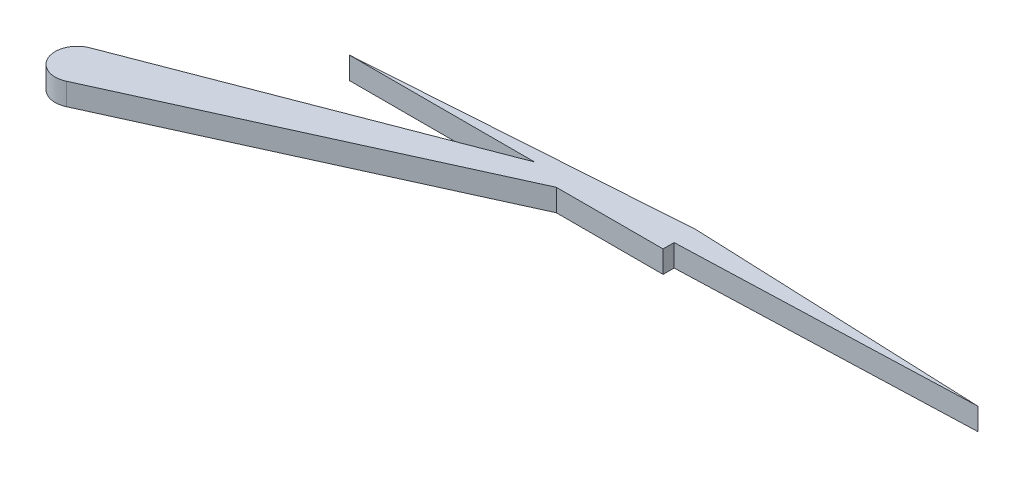
ISO-10303-21;
HEADER;
FILE_DESCRIPTION(('STEP AP214'),'2;1');
FILE_NAME('part.step','',(''),(''),'','','');
FILE_SCHEMA(('AUTOMOTIVE_DESIGN { 1 0 10303 214 1 1 1 1 }'));
ENDSEC;
DATA;
#1=APPLICATION_CONTEXT('core data for automotive mechanical design processes');
#2=APPLICATION_PROTOCOL_DEFINITION('international standard','automotive_design',2000,#1);
#3=PRODUCT_CONTEXT('',#1,'mechanical');
#4=PRODUCT('Part','Part','',(#3));
#5=PRODUCT_RELATED_PRODUCT_CATEGORY('part','',(#4));
#6=PRODUCT_DEFINITION_FORMATION('','',#4);
#7=PRODUCT_DEFINITION_CONTEXT('part definition',#1,'design');
#8=PRODUCT_DEFINITION('design','',#6,#7);
#9=PRODUCT_DEFINITION_SHAPE('','',#8);
#10=(LENGTH_UNIT() NAMED_UNIT(*) SI_UNIT(.MILLI.,.METRE.));
#11=(NAMED_UNIT(*) PLANE_ANGLE_UNIT() SI_UNIT($,.RADIAN.));
#12=(NAMED_UNIT(*) SI_UNIT($,.STERADIAN.) SOLID_ANGLE_UNIT());
#13=UNCERTAINTY_MEASURE_WITH_UNIT(LENGTH_MEASURE(1.E-05),#10,'distance_accuracy_value','');
#14=(GEOMETRIC_REPRESENTATION_CONTEXT(3) GLOBAL_UNCERTAINTY_ASSIGNED_CONTEXT((#13)) GLOBAL_UNIT_ASSIGNED_CONTEXT((#10,
#11,#12)) REPRESENTATION_CONTEXT('',''));
#15=CARTESIAN_POINT('',(0.,0.,0.));
#16=DIRECTION('',(0.,0.,1.));
#17=DIRECTION('',(1.,0.,0.));
#18=AXIS2_PLACEMENT_3D('',#15,#16,#17);
#19=CARTESIAN_POINT('',(0.,1.,0.));
#20=DIRECTION('',(0.,-1.,0.));
#21=DIRECTION('',(0.,0.,-1.));
#22=AXIS2_PLACEMENT_3D('',#19,#20,#21);
#23=CYLINDRICAL_SURFACE('',#22,1.);
#24=CARTESIAN_POINT('',(0.,0.,0.));
#25=DIRECTION('',(0.,1.,0.));
#26=DIRECTION('',(0.,0.,1.));
#27=AXIS2_PLACEMENT_3D('',#24,#25,#26);
#28=CIRCLE('',#27,1.);
#29=CARTESIAN_POINT('',(-0.358770303239401,0.,-0.933425877889353));
#30=VERTEX_POINT('',#29);
#31=CARTESIAN_POINT('',(0.413795285143604,0.,0.910369958858992));
#32=VERTEX_POINT('',#31);
#33=EDGE_CURVE('E174',#30,#32,#28,.T.);
#34=ORIENTED_EDGE('',*,*,#33,.T.);
#35=DIRECTION('',(0.,-1.,0.));
#36=VECTOR('',#35,1.);
#37=CARTESIAN_POINT('',(0.413795285143604,1.,0.910369958858992));
#38=LINE('',#37,#36);
#39=CARTESIAN_POINT('',(0.413795285143604,1.,0.910369958858992));
#40=VERTEX_POINT('',#39);
#41=EDGE_CURVE('E11',#40,#32,#38,.T.);
#42=ORIENTED_EDGE('',*,*,#41,.F.);
#43=CARTESIAN_POINT('',(0.,1.,0.));
#44=DIRECTION('',(0.,1.,0.));
#45=DIRECTION('',(0.,0.,1.));
#46=AXIS2_PLACEMENT_3D('',#43,#44,#45);
#47=CIRCLE('',#46,1.);
#48=CARTESIAN_POINT('',(-0.358770303239401,1.,-0.933425877889353));
#49=VERTEX_POINT('',#48);
#50=EDGE_CURVE('E175',#49,#40,#47,.T.);
#51=ORIENTED_EDGE('',*,*,#50,.F.);
#52=DIRECTION('',(0.,-1.,0.));
#53=VECTOR('',#52,1.);
#54=CARTESIAN_POINT('',(-0.358770303239401,1.,-0.933425877889353));
#55=LINE('',#54,#53);
#56=EDGE_CURVE('E189',#49,#30,#55,.T.);
#57=ORIENTED_EDGE('',*,*,#56,.T.);
#58=EDGE_LOOP('',(#34,#42,#51,#57));
#59=FACE_BOUND('',#58,.T.);
#60=ADVANCED_FACE('F39',(#59),#23,.T.);
#61=CARTESIAN_POINT('',(15.6662886250529,1.,-6.02242672376556));
#62=DIRECTION('',(-0.413795285143604,0.,-0.910369958858992));
#63=DIRECTION('',(-0.910369958858992,0.,0.413795285143604));
#64=AXIS2_PLACEMENT_3D('',#61,#62,#63);
#65=PLANE('',#64);
#66=DIRECTION('',(0.910369958858992,0.,-0.413795285143604));
#67=VECTOR('',#66,1.);
#68=CARTESIAN_POINT('',(15.6662886250529,0.,-6.02242672376556));
#69=LINE('',#68,#67);
#70=CARTESIAN_POINT('',(15.6662886250529,0.,-6.02242672376556));
#71=VERTEX_POINT('',#70);
#72=EDGE_CURVE('E193',#32,#71,#69,.T.);
#73=ORIENTED_EDGE('',*,*,#72,.T.);
#74=DIRECTION('',(0.,-1.,0.));
#75=VECTOR('',#74,1.);
#76=CARTESIAN_POINT('',(15.6662886250529,1.,-6.02242672376556));
#77=LINE('',#76,#75);
#78=CARTESIAN_POINT('',(15.6662886250529,1.,-6.02242672376556));
#79=VERTEX_POINT('',#78);
#80=EDGE_CURVE('E47',#79,#71,#77,.T.);
#81=ORIENTED_EDGE('',*,*,#80,.F.);
#82=DIRECTION('',(0.910369958858992,0.,-0.413795285143604));
#83=VECTOR('',#82,1.);
#84=CARTESIAN_POINT('',(15.6662886250529,1.,-6.02242672376556));
#85=LINE('',#84,#83);
#86=EDGE_CURVE('E89',#40,#79,#85,.T.);
#87=ORIENTED_EDGE('',*,*,#86,.F.);
#88=ORIENTED_EDGE('',*,*,#41,.T.);
#89=EDGE_LOOP('',(#73,#81,#87,#88));
#90=FACE_BOUND('',#89,.T.);
#91=ADVANCED_FACE('F224',(#90),#65,.F.);
#92=CARTESIAN_POINT('',(20.5006009830959,1.,-6.02242672376556));
#93=DIRECTION('',(0.,0.,-1.));
#94=DIRECTION('',(-1.,0.,0.));
#95=AXIS2_PLACEMENT_3D('',#92,#93,#94);
#96=PLANE('',#95);
#97=DIRECTION('',(1.,0.,0.));
#98=VECTOR('',#97,1.);
#99=CARTESIAN_POINT('',(20.5006009830959,0.,-6.02242672376556));
#100=LINE('',#99,#98);
#101=CARTESIAN_POINT('',(20.5006009830959,0.,-6.02242672376556));
#102=VERTEX_POINT('',#101);
#103=EDGE_CURVE('E196',#71,#102,#100,.T.);
#104=ORIENTED_EDGE('',*,*,#103,.T.);
#105=DIRECTION('',(0.,-1.,0.));
#106=VECTOR('',#105,1.);
#107=CARTESIAN_POINT('',(20.5006009830959,1.,-6.02242672376556));
#108=LINE('',#107,#106);
#109=CARTESIAN_POINT('',(20.5006009830959,1.,-6.02242672376556));
#110=VERTEX_POINT('',#109);
#111=EDGE_CURVE('E206',#110,#102,#108,.T.);
#112=ORIENTED_EDGE('',*,*,#111,.F.);
#113=DIRECTION('',(1.,0.,0.));
#114=VECTOR('',#113,1.);
#115=CARTESIAN_POINT('',(20.5006009830959,1.,-6.02242672376556));
#116=LINE('',#115,#114);
#117=EDGE_CURVE('E180',#79,#110,#116,.T.);
#118=ORIENTED_EDGE('',*,*,#117,.F.);
#119=ORIENTED_EDGE('',*,*,#80,.T.);
#120=EDGE_LOOP('',(#104,#112,#118,#119));
#121=FACE_BOUND('',#120,.T.);
#122=ADVANCED_FACE('F214',(#121),#96,.F.);
#123=CARTESIAN_POINT('',(20.5006009830959,1.,-7.02242672376556));
#124=DIRECTION('',(-1.,0.,0.));
#125=DIRECTION('',(0.,0.,1.));
#126=AXIS2_PLACEMENT_3D('',#123,#124,#125);
#127=PLANE('',#126);
#128=DIRECTION('',(0.,0.,-1.));
#129=VECTOR('',#128,1.);
#130=CARTESIAN_POINT('',(20.5006009830959,0.,-7.02242672376556));
#131=LINE('',#130,#129);
#132=CARTESIAN_POINT('',(20.5006009830959,0.,-6.52242672376556));
#133=VERTEX_POINT('',#132);
#134=EDGE_CURVE('E199',#102,#133,#131,.T.);
#135=ORIENTED_EDGE('',*,*,#134,.T.);
#136=DIRECTION('',(0.,1.,0.));
#137=VECTOR('',#136,1.);
#138=CARTESIAN_POINT('',(20.5006009830959,0.,-6.52242672376556));
#139=LINE('',#138,#137);
#140=CARTESIAN_POINT('',(20.5006009830959,1.,-6.52242672376556));
#141=VERTEX_POINT('',#140);
#142=EDGE_CURVE('E146',#133,#141,#139,.T.);
#143=ORIENTED_EDGE('',*,*,#142,.T.);
#144=DIRECTION('',(0.,0.,-1.));
#145=VECTOR('',#144,1.);
#146=CARTESIAN_POINT('',(20.5006009830959,1.,-7.02242672376556));
#147=LINE('',#146,#145);
#148=EDGE_CURVE('E183',#110,#141,#147,.T.);
#149=ORIENTED_EDGE('',*,*,#148,.F.);
#150=ORIENTED_EDGE('',*,*,#111,.T.);
#151=EDGE_LOOP('',(#135,#143,#149,#150));
#152=FACE_BOUND('',#151,.T.);
#153=ADVANCED_FACE('F218',(#152),#127,.F.);
#154=CARTESIAN_POINT('',(-0.358770303239401,1.,-0.933425877889353));
#155=DIRECTION('',(0.358770303239401,0.,0.933425877889352));
#156=DIRECTION('',(0.933425877889352,0.,-0.358770303239401));
#157=AXIS2_PLACEMENT_3D('',#154,#155,#156);
#158=PLANE('',#157);
#159=DIRECTION('',(-0.933425877889352,0.,0.358770303239401));
#160=VECTOR('',#159,1.);
#161=CARTESIAN_POINT('',(-0.358770303239401,1.,-0.933425877889353));
#162=LINE('',#161,#160);
#163=CARTESIAN_POINT('',(14.1823385175907,1.,-6.52242672376556));
#164=VERTEX_POINT('',#163);
#165=EDGE_CURVE('E60',#164,#49,#162,.T.);
#166=ORIENTED_EDGE('',*,*,#165,.F.);
#167=DIRECTION('',(0.,-1.,0.));
#168=VECTOR('',#167,1.);
#169=CARTESIAN_POINT('',(14.1823385175907,1.,-6.52242672376556));
#170=LINE('',#169,#168);
#171=CARTESIAN_POINT('',(14.1823385175907,0.,-6.52242672376556));
#172=VERTEX_POINT('',#171);
#173=EDGE_CURVE('E166',#164,#172,#170,.T.);
#174=ORIENTED_EDGE('',*,*,#173,.T.);
#175=DIRECTION('',(-0.933425877889352,0.,0.358770303239401));
#176=VECTOR('',#175,1.);
#177=CARTESIAN_POINT('',(-0.358770303239401,0.,-0.933425877889353));
#178=LINE('',#177,#176);
#179=EDGE_CURVE('E82',#172,#30,#178,.T.);
#180=ORIENTED_EDGE('',*,*,#179,.T.);
#181=ORIENTED_EDGE('',*,*,#56,.F.);
#182=EDGE_LOOP('',(#166,#174,#180,#181));
#183=FACE_BOUND('',#182,.T.);
#184=ADVANCED_FACE('F234',(#183),#158,.F.);
#185=CARTESIAN_POINT('',(0.,1.,0.));
#186=DIRECTION('',(0.,1.,0.));
#187=DIRECTION('',(0.,0.,1.));
#188=AXIS2_PLACEMENT_3D('',#185,#186,#187);
#189=PLANE('',#188);
#190=ORIENTED_EDGE('',*,*,#148,.T.);
#191=DIRECTION('',(0.999399596360731,0.,-0.0346474644672442));
#192=VECTOR('',#191,1.);
#193=CARTESIAN_POINT('',(33.7965870195343,1.,-6.98337568295265));
#194=LINE('',#193,#192);
#195=CARTESIAN_POINT('',(33.7965870195343,1.,-6.98337568295265));
#196=VERTEX_POINT('',#195);
#197=EDGE_CURVE('E157',#141,#196,#194,.T.);
#198=ORIENTED_EDGE('',*,*,#197,.T.);
#199=DIRECTION('',(-0.999172103467006,0.,-0.0406830143096367));
#200=VECTOR('',#199,1.);
#201=CARTESIAN_POINT('',(20.5006009830959,1.,-7.52474467064178));
#202=LINE('',#201,#200);
#203=CARTESIAN_POINT('',(20.5006009830959,1.,-7.52474467064178));
#204=VERTEX_POINT('',#203);
#205=EDGE_CURVE('E124',#196,#204,#202,.T.);
#206=ORIENTED_EDGE('',*,*,#205,.T.);
#207=DIRECTION('',(-0.997684744575964,0.,0.0680084585944505));
#208=VECTOR('',#207,1.);
#209=CARTESIAN_POINT('',(5.79658701953425,1.,-6.52242672376556));
#210=LINE('',#209,#208);
#211=CARTESIAN_POINT('',(5.79658701953425,1.,-6.52242672376556));
#212=VERTEX_POINT('',#211);
#213=EDGE_CURVE('E150',#204,#212,#210,.T.);
#214=ORIENTED_EDGE('',*,*,#213,.T.);
#215=DIRECTION('',(1.,0.,0.));
#216=VECTOR('',#215,1.);
#217=CARTESIAN_POINT('',(20.5006009830959,1.,-6.52242672376556));
#218=LINE('',#217,#216);
#219=EDGE_CURVE('E54',#212,#164,#218,.T.);
#220=ORIENTED_EDGE('',*,*,#219,.T.);
#221=ORIENTED_EDGE('',*,*,#165,.T.);
#222=ORIENTED_EDGE('',*,*,#50,.T.);
#223=ORIENTED_EDGE('',*,*,#86,.T.);
#224=ORIENTED_EDGE('',*,*,#117,.T.);
#225=EDGE_LOOP('',(#190,#198,#206,#214,#220,#221,#222,#223,#224));
#226=FACE_BOUND('',#225,.T.);
#227=ADVANCED_FACE('F220',(#226),#189,.T.);
#228=CARTESIAN_POINT('',(0.,0.,0.));
#229=DIRECTION('',(0.,1.,0.));
#230=DIRECTION('',(0.,0.,1.));
#231=AXIS2_PLACEMENT_3D('',#228,#229,#230);
#232=PLANE('',#231);
#233=ORIENTED_EDGE('',*,*,#179,.F.);
#234=DIRECTION('',(1.,0.,0.));
#235=VECTOR('',#234,1.);
#236=CARTESIAN_POINT('',(20.5006009830959,0.,-6.52242672376556));
#237=LINE('',#236,#235);
#238=CARTESIAN_POINT('',(5.79658701953425,0.,-6.52242672376556));
#239=VERTEX_POINT('',#238);
#240=EDGE_CURVE('E130',#239,#172,#237,.T.);
#241=ORIENTED_EDGE('',*,*,#240,.F.);
#242=DIRECTION('',(-0.997684744575964,0.,0.0680084585944505));
#243=VECTOR('',#242,1.);
#244=CARTESIAN_POINT('',(5.79658701953425,0.,-6.52242672376556));
#245=LINE('',#244,#243);
#246=CARTESIAN_POINT('',(20.5006009830959,0.,-7.52474467064178));
#247=VERTEX_POINT('',#246);
#248=EDGE_CURVE('E141',#247,#239,#245,.T.);
#249=ORIENTED_EDGE('',*,*,#248,.F.);
#250=DIRECTION('',(-0.999172103467006,0.,-0.0406830143096367));
#251=VECTOR('',#250,1.);
#252=CARTESIAN_POINT('',(20.5006009830959,0.,-7.52474467064178));
#253=LINE('',#252,#251);
#254=CARTESIAN_POINT('',(33.7965870195343,0.,-6.98337568295265));
#255=VERTEX_POINT('',#254);
#256=EDGE_CURVE('E122',#255,#247,#253,.T.);
#257=ORIENTED_EDGE('',*,*,#256,.F.);
#258=DIRECTION('',(0.999399596360731,0.,-0.0346474644672442));
#259=VECTOR('',#258,1.);
#260=CARTESIAN_POINT('',(33.7965870195343,0.,-6.98337568295265));
#261=LINE('',#260,#259);
#262=EDGE_CURVE('E137',#133,#255,#261,.T.);
#263=ORIENTED_EDGE('',*,*,#262,.F.);
#264=ORIENTED_EDGE('',*,*,#134,.F.);
#265=ORIENTED_EDGE('',*,*,#103,.F.);
#266=ORIENTED_EDGE('',*,*,#72,.F.);
#267=ORIENTED_EDGE('',*,*,#33,.F.);
#268=EDGE_LOOP('',(#233,#241,#249,#257,#263,#264,#265,#266,#267));
#269=FACE_BOUND('',#268,.T.);
#270=ADVANCED_FACE('F135',(#269),#232,.F.);
#271=CARTESIAN_POINT('',(20.5006009830959,0.,-6.52242672376556));
#272=DIRECTION('',(0.,0.,1.));
#273=DIRECTION('',(1.,0.,0.));
#274=AXIS2_PLACEMENT_3D('',#271,#272,#273);
#275=PLANE('',#274);
#276=ORIENTED_EDGE('',*,*,#173,.F.);
#277=ORIENTED_EDGE('',*,*,#219,.F.);
#278=DIRECTION('',(0.,1.,0.));
#279=VECTOR('',#278,1.);
#280=CARTESIAN_POINT('',(5.79658701953425,0.,-6.52242672376556));
#281=LINE('',#280,#279);
#282=EDGE_CURVE('E167',#239,#212,#281,.T.);
#283=ORIENTED_EDGE('',*,*,#282,.F.);
#284=ORIENTED_EDGE('',*,*,#240,.T.);
#285=EDGE_LOOP('',(#276,#277,#283,#284));
#286=FACE_BOUND('',#285,.T.);
#287=ADVANCED_FACE('F239',(#286),#275,.T.);
#288=CARTESIAN_POINT('',(33.7965870195343,0.,-6.98337568295265));
#289=DIRECTION('',(0.0346474644672442,0.,0.999399596360731));
#290=DIRECTION('',(0.999399596360731,0.,-0.0346474644672442));
#291=AXIS2_PLACEMENT_3D('',#288,#289,#290);
#292=PLANE('',#291);
#293=ORIENTED_EDGE('',*,*,#197,.F.);
#294=ORIENTED_EDGE('',*,*,#142,.F.);
#295=ORIENTED_EDGE('',*,*,#262,.T.);
#296=DIRECTION('',(0.,1.,0.));
#297=VECTOR('',#296,1.);
#298=CARTESIAN_POINT('',(33.7965870195343,0.,-6.98337568295265));
#299=LINE('',#298,#297);
#300=EDGE_CURVE('E119',#255,#196,#299,.T.);
#301=ORIENTED_EDGE('',*,*,#300,.T.);
#302=EDGE_LOOP('',(#293,#294,#295,#301));
#303=FACE_BOUND('',#302,.T.);
#304=ADVANCED_FACE('F144',(#303),#292,.T.);
#305=CARTESIAN_POINT('',(5.79658701953425,0.,-6.52242672376556));
#306=DIRECTION('',(-0.0680084585944505,0.,-0.997684744575964));
#307=DIRECTION('',(-0.997684744575964,0.,0.0680084585944505));
#308=AXIS2_PLACEMENT_3D('',#305,#306,#307);
#309=PLANE('',#308);
#310=ORIENTED_EDGE('',*,*,#213,.F.);
#311=DIRECTION('',(0.,1.,0.));
#312=VECTOR('',#311,1.);
#313=CARTESIAN_POINT('',(20.5006009830959,0.,-7.52474467064178));
#314=LINE('',#313,#312);
#315=EDGE_CURVE('E129',#247,#204,#314,.T.);
#316=ORIENTED_EDGE('',*,*,#315,.F.);
#317=ORIENTED_EDGE('',*,*,#248,.T.);
#318=ORIENTED_EDGE('',*,*,#282,.T.);
#319=EDGE_LOOP('',(#310,#316,#317,#318));
#320=FACE_BOUND('',#319,.T.);
#321=ADVANCED_FACE('F244',(#320),#309,.T.);
#322=CARTESIAN_POINT('',(20.5006009830959,0.,-7.52474467064178));
#323=DIRECTION('',(0.0406830143096367,0.,-0.999172103467006));
#324=DIRECTION('',(-0.999172103467006,0.,-0.0406830143096367));
#325=AXIS2_PLACEMENT_3D('',#322,#323,#324);
#326=PLANE('',#325);
#327=ORIENTED_EDGE('',*,*,#205,.F.);
#328=ORIENTED_EDGE('',*,*,#300,.F.);
#329=ORIENTED_EDGE('',*,*,#256,.T.);
#330=ORIENTED_EDGE('',*,*,#315,.T.);
#331=EDGE_LOOP('',(#327,#328,#329,#330));
#332=FACE_BOUND('',#331,.T.);
#333=ADVANCED_FACE('F121',(#332),#326,.T.);
#334=CLOSED_SHELL('',(#60,#91,#122,#153,#184,#227,#270,#287,#304,#321,#333));
#335=MANIFOLD_SOLID_BREP('B2',#334);
#336=ADVANCED_BREP_SHAPE_REPRESENTATION('',(#18,#335),#14);
#337=SHAPE_DEFINITION_REPRESENTATION(#9,#336);
ENDSEC;
END-ISO-10303-21;
